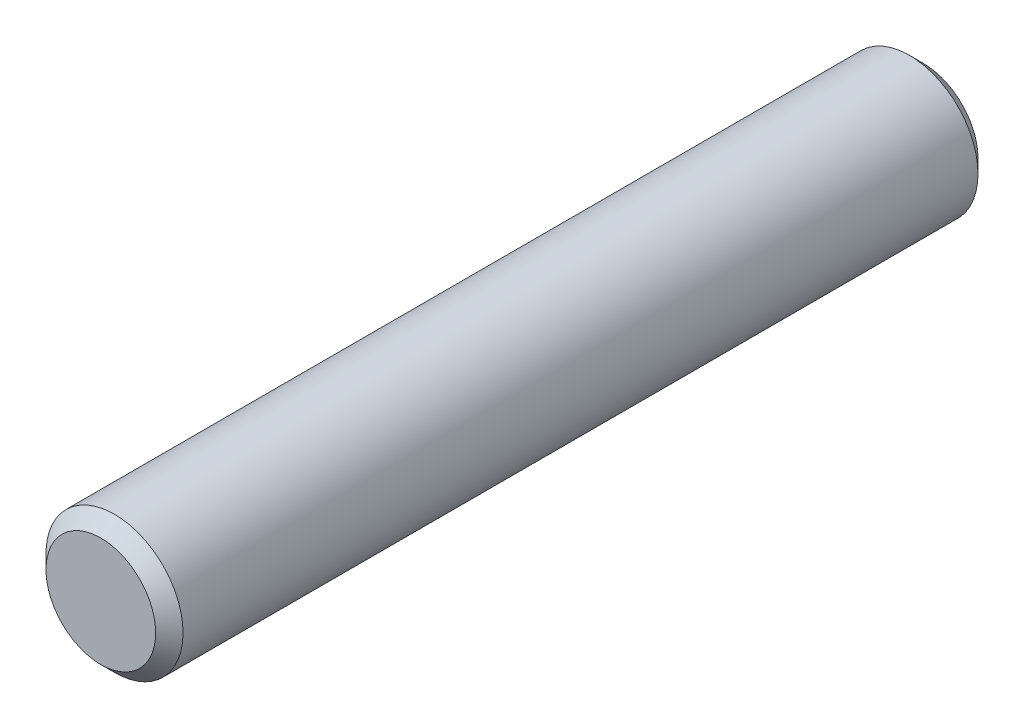
ISO-10303-21;
HEADER;
FILE_DESCRIPTION(('STEP AP214'),'2;1');
FILE_NAME('part.step','',(''),(''),'','','');
FILE_SCHEMA(('AUTOMOTIVE_DESIGN { 1 0 10303 214 1 1 1 1 }'));
ENDSEC;
DATA;
#1=APPLICATION_CONTEXT('core data for automotive mechanical design processes');
#2=APPLICATION_PROTOCOL_DEFINITION('international standard','automotive_design',2000,#1);
#3=PRODUCT_CONTEXT('',#1,'mechanical');
#4=PRODUCT('Part','Part','',(#3));
#5=PRODUCT_RELATED_PRODUCT_CATEGORY('part','',(#4));
#6=PRODUCT_DEFINITION_FORMATION('','',#4);
#7=PRODUCT_DEFINITION_CONTEXT('part definition',#1,'design');
#8=PRODUCT_DEFINITION('design','',#6,#7);
#9=PRODUCT_DEFINITION_SHAPE('','',#8);
#10=(LENGTH_UNIT() NAMED_UNIT(*) SI_UNIT(.MILLI.,.METRE.));
#11=(NAMED_UNIT(*) PLANE_ANGLE_UNIT() SI_UNIT($,.RADIAN.));
#12=(NAMED_UNIT(*) SI_UNIT($,.STERADIAN.) SOLID_ANGLE_UNIT());
#13=UNCERTAINTY_MEASURE_WITH_UNIT(LENGTH_MEASURE(1.E-05),#10,'distance_accuracy_value','');
#14=(GEOMETRIC_REPRESENTATION_CONTEXT(3) GLOBAL_UNCERTAINTY_ASSIGNED_CONTEXT((#13)) GLOBAL_UNIT_ASSIGNED_CONTEXT((#10,
#11,#12)) REPRESENTATION_CONTEXT('',''));
#15=CARTESIAN_POINT('',(0.,0.,0.));
#16=DIRECTION('',(0.,0.,1.));
#17=DIRECTION('',(1.,0.,0.));
#18=AXIS2_PLACEMENT_3D('',#15,#16,#17);
#19=CARTESIAN_POINT('',(0.,0.,15.));
#20=DIRECTION('',(0.,0.,-1.));
#21=DIRECTION('',(-1.,0.,0.));
#22=AXIS2_PLACEMENT_3D('',#19,#20,#21);
#23=CYLINDRICAL_SURFACE('',#22,2.5);
#24=CARTESIAN_POINT('',(0.,0.,-14.5));
#25=DIRECTION('',(0.,0.,1.));
#26=DIRECTION('',(1.,0.,0.));
#27=AXIS2_PLACEMENT_3D('',#24,#25,#26);
#28=CIRCLE('',#27,2.5);
#29=CARTESIAN_POINT('',(2.5,0.,-14.5));
#30=VERTEX_POINT('',#29);
#31=EDGE_CURVE('E59',#30,#30,#28,.T.);
#32=ORIENTED_EDGE('',*,*,#31,.T.);
#33=EDGE_LOOP('',(#32));
#34=FACE_BOUND('',#33,.T.);
#35=CARTESIAN_POINT('',(0.,0.,14.5));
#36=DIRECTION('',(0.,0.,1.));
#37=DIRECTION('',(1.,0.,0.));
#38=AXIS2_PLACEMENT_3D('',#35,#36,#37);
#39=CIRCLE('',#38,2.5);
#40=CARTESIAN_POINT('',(2.5,0.,14.5));
#41=VERTEX_POINT('',#40);
#42=EDGE_CURVE('E64',#41,#41,#39,.F.);
#43=ORIENTED_EDGE('',*,*,#42,.T.);
#44=EDGE_LOOP('',(#43));
#45=FACE_BOUND('',#44,.T.);
#46=ADVANCED_FACE('F45',(#34,#45),#23,.T.);
#47=CARTESIAN_POINT('',(0.,0.,15.));
#48=DIRECTION('',(0.,0.,1.));
#49=DIRECTION('',(1.,0.,0.));
#50=AXIS2_PLACEMENT_3D('',#47,#48,#49);
#51=PLANE('',#50);
#52=CARTESIAN_POINT('',(0.,0.,15.));
#53=DIRECTION('',(0.,0.,1.));
#54=DIRECTION('',(1.,0.,0.));
#55=AXIS2_PLACEMENT_3D('',#52,#53,#54);
#56=CIRCLE('',#55,2.);
#57=CARTESIAN_POINT('',(2.,0.,15.));
#58=VERTEX_POINT('',#57);
#59=EDGE_CURVE('E10',#58,#58,#56,.T.);
#60=ORIENTED_EDGE('',*,*,#59,.T.);
#61=EDGE_LOOP('',(#60));
#62=FACE_BOUND('',#61,.T.);
#63=ADVANCED_FACE('F81',(#62),#51,.T.);
#64=CARTESIAN_POINT('',(0.,0.,-15.));
#65=DIRECTION('',(0.,0.,1.));
#66=DIRECTION('',(1.,0.,0.));
#67=AXIS2_PLACEMENT_3D('',#64,#65,#66);
#68=PLANE('',#67);
#69=CARTESIAN_POINT('',(0.,0.,-15.));
#70=DIRECTION('',(0.,0.,1.));
#71=DIRECTION('',(1.,0.,0.));
#72=AXIS2_PLACEMENT_3D('',#69,#70,#71);
#73=CIRCLE('',#72,2.);
#74=CARTESIAN_POINT('',(2.,0.,-15.));
#75=VERTEX_POINT('',#74);
#76=EDGE_CURVE('E54',#75,#75,#73,.F.);
#77=ORIENTED_EDGE('',*,*,#76,.T.);
#78=EDGE_LOOP('',(#77));
#79=FACE_BOUND('',#78,.T.);
#80=ADVANCED_FACE('F78',(#79),#68,.F.);
#81=CARTESIAN_POINT('',(0.,0.,-14.5));
#82=DIRECTION('',(0.,0.,1.));
#83=DIRECTION('',(1.,0.,0.));
#84=AXIS2_PLACEMENT_3D('',#81,#82,#83);
#85=CONICAL_SURFACE('',#84,2.5,0.785398163397446);
#86=ORIENTED_EDGE('',*,*,#76,.F.);
#87=EDGE_LOOP('',(#86));
#88=FACE_BOUND('',#87,.T.);
#89=ORIENTED_EDGE('',*,*,#31,.F.);
#90=EDGE_LOOP('',(#89));
#91=FACE_BOUND('',#90,.T.);
#92=ADVANCED_FACE('F74',(#88,#91),#85,.T.);
#93=CARTESIAN_POINT('',(0.,0.,15.));
#94=DIRECTION('',(0.,0.,-1.));
#95=DIRECTION('',(-1.,0.,0.));
#96=AXIS2_PLACEMENT_3D('',#93,#94,#95);
#97=CONICAL_SURFACE('',#96,2.,0.785398163397443);
#98=ORIENTED_EDGE('',*,*,#42,.F.);
#99=EDGE_LOOP('',(#98));
#100=FACE_BOUND('',#99,.T.);
#101=ORIENTED_EDGE('',*,*,#59,.F.);
#102=EDGE_LOOP('',(#101));
#103=FACE_BOUND('',#102,.T.);
#104=ADVANCED_FACE('F48',(#100,#103),#97,.T.);
#105=CLOSED_SHELL('',(#46,#63,#80,#92,#104));
#106=MANIFOLD_SOLID_BREP('B2',#105);
#107=ADVANCED_BREP_SHAPE_REPRESENTATION('',(#18,#106),#14);
#108=SHAPE_DEFINITION_REPRESENTATION(#9,#107);
ENDSEC;
END-ISO-10303-21;
